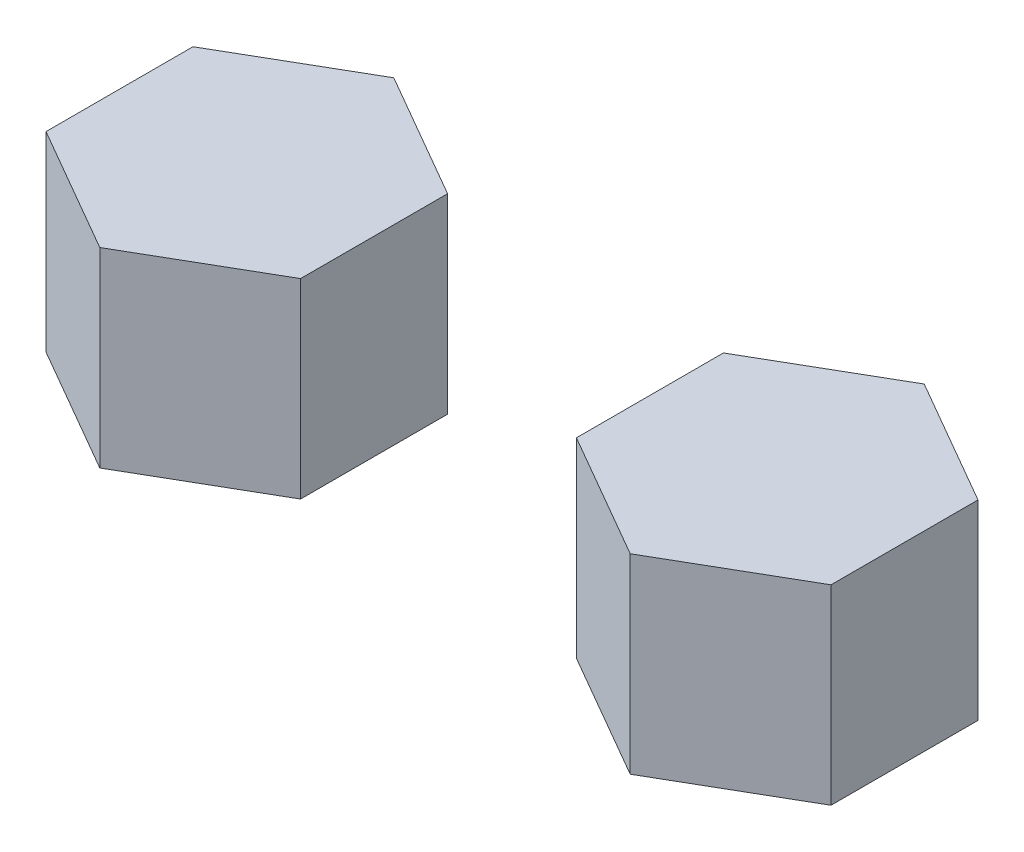
ISO-10303-21;
HEADER;
FILE_DESCRIPTION(('STEP AP214'),'2;1');
FILE_NAME('part.step','',(''),(''),'','','');
FILE_SCHEMA(('AUTOMOTIVE_DESIGN { 1 0 10303 214 1 1 1 1 }'));
ENDSEC;
DATA;
#1=APPLICATION_CONTEXT('core data for automotive mechanical design processes');
#2=APPLICATION_PROTOCOL_DEFINITION('international standard','automotive_design',2000,#1);
#3=PRODUCT_CONTEXT('',#1,'mechanical');
#4=PRODUCT('Part','Part','',(#3));
#5=PRODUCT_RELATED_PRODUCT_CATEGORY('part','',(#4));
#6=PRODUCT_DEFINITION_FORMATION('','',#4);
#7=PRODUCT_DEFINITION_CONTEXT('part definition',#1,'design');
#8=PRODUCT_DEFINITION('design','',#6,#7);
#9=PRODUCT_DEFINITION_SHAPE('','',#8);
#10=(LENGTH_UNIT() NAMED_UNIT(*) SI_UNIT(.MILLI.,.METRE.));
#11=(NAMED_UNIT(*) PLANE_ANGLE_UNIT() SI_UNIT($,.RADIAN.));
#12=(NAMED_UNIT(*) SI_UNIT($,.STERADIAN.) SOLID_ANGLE_UNIT());
#13=UNCERTAINTY_MEASURE_WITH_UNIT(LENGTH_MEASURE(1.E-05),#10,'distance_accuracy_value','');
#14=(GEOMETRIC_REPRESENTATION_CONTEXT(3) GLOBAL_UNCERTAINTY_ASSIGNED_CONTEXT((#13)) GLOBAL_UNIT_ASSIGNED_CONTEXT((#10,
#11,#12)) REPRESENTATION_CONTEXT('',''));
#15=CARTESIAN_POINT('',(0.,0.,0.));
#16=DIRECTION('',(0.,0.,1.));
#17=DIRECTION('',(1.,0.,0.));
#18=AXIS2_PLACEMENT_3D('',#15,#16,#17);
#19=CARTESIAN_POINT('',(-160.,-2.,-101.773502691896));
#20=DIRECTION('',(1.,0.,0.));
#21=DIRECTION('',(0.,0.,1.));
#22=AXIS2_PLACEMENT_3D('',#19,#20,#21);
#23=PLANE('',#22);
#24=DIRECTION('',(0.,0.,1.));
#25=VECTOR('',#24,1.);
#26=CARTESIAN_POINT('',(-160.,-20.,-101.773502691896));
#27=LINE('',#26,#25);
#28=CARTESIAN_POINT('',(-160.,-20.,-101.773502691896));
#29=VERTEX_POINT('',#28);
#30=CARTESIAN_POINT('',(-160.,-20.,-87.9170962313453));
#31=VERTEX_POINT('',#30);
#32=EDGE_CURVE('E144',#29,#31,#27,.T.);
#33=ORIENTED_EDGE('',*,*,#32,.T.);
#34=DIRECTION('',(0.,-1.,0.));
#35=VECTOR('',#34,1.);
#36=CARTESIAN_POINT('',(-160.,-2.,-87.9170962313453));
#37=LINE('',#36,#35);
#38=CARTESIAN_POINT('',(-160.,-2.,-87.9170962313453));
#39=VERTEX_POINT('',#38);
#40=EDGE_CURVE('E11',#39,#31,#37,.T.);
#41=ORIENTED_EDGE('',*,*,#40,.F.);
#42=DIRECTION('',(0.,0.,1.));
#43=VECTOR('',#42,1.);
#44=CARTESIAN_POINT('',(-160.,-2.,-101.773502691896));
#45=LINE('',#44,#43);
#46=CARTESIAN_POINT('',(-160.,-2.,-101.773502691896));
#47=VERTEX_POINT('',#46);
#48=EDGE_CURVE('E587',#47,#39,#45,.T.);
#49=ORIENTED_EDGE('',*,*,#48,.F.);
#50=DIRECTION('',(0.,-1.,0.));
#51=VECTOR('',#50,1.);
#52=CARTESIAN_POINT('',(-160.,-2.,-101.773502691896));
#53=LINE('',#52,#51);
#54=EDGE_CURVE('E162',#47,#29,#53,.T.);
#55=ORIENTED_EDGE('',*,*,#54,.T.);
#56=EDGE_LOOP('',(#33,#41,#49,#55));
#57=FACE_BOUND('',#56,.T.);
#58=ADVANCED_FACE('F17',(#57),#23,.F.);
#59=CARTESIAN_POINT('',(-160.,-2.,-87.9170962313453));
#60=DIRECTION('',(0.5,0.,-0.866025403784437));
#61=DIRECTION('',(0.866025403784437,0.,0.5));
#62=AXIS2_PLACEMENT_3D('',#59,#60,#61);
#63=PLANE('',#62);
#64=DIRECTION('',(0.866025403784437,0.,0.5));
#65=VECTOR('',#64,1.);
#66=CARTESIAN_POINT('',(-160.,-20.,-87.9170962313453));
#67=LINE('',#66,#65);
#68=CARTESIAN_POINT('',(-148.,-20.,-80.9888930010697));
#69=VERTEX_POINT('',#68);
#70=EDGE_CURVE('E148',#31,#69,#67,.T.);
#71=ORIENTED_EDGE('',*,*,#70,.T.);
#72=DIRECTION('',(0.,-1.,0.));
#73=VECTOR('',#72,1.);
#74=CARTESIAN_POINT('',(-148.,-2.,-80.9888930010697));
#75=LINE('',#74,#73);
#76=CARTESIAN_POINT('',(-148.,-2.,-80.9888930010697));
#77=VERTEX_POINT('',#76);
#78=EDGE_CURVE('E27',#77,#69,#75,.T.);
#79=ORIENTED_EDGE('',*,*,#78,.F.);
#80=DIRECTION('',(0.866025403784437,0.,0.5));
#81=VECTOR('',#80,1.);
#82=CARTESIAN_POINT('',(-160.,-2.,-87.9170962313453));
#83=LINE('',#82,#81);
#84=EDGE_CURVE('E590',#39,#77,#83,.T.);
#85=ORIENTED_EDGE('',*,*,#84,.F.);
#86=ORIENTED_EDGE('',*,*,#40,.T.);
#87=EDGE_LOOP('',(#71,#79,#85,#86));
#88=FACE_BOUND('',#87,.T.);
#89=ADVANCED_FACE('F393',(#88),#63,.F.);
#90=CARTESIAN_POINT('',(-148.,-2.,-80.9888930010697));
#91=DIRECTION('',(-0.5,0.,-0.86602540378444));
#92=DIRECTION('',(0.86602540378444,0.,-0.5));
#93=AXIS2_PLACEMENT_3D('',#90,#91,#92);
#94=PLANE('',#93);
#95=DIRECTION('',(0.86602540378444,0.,-0.5));
#96=VECTOR('',#95,1.);
#97=CARTESIAN_POINT('',(-148.,-20.,-80.9888930010697));
#98=LINE('',#97,#96);
#99=CARTESIAN_POINT('',(-136.,-20.,-87.9170962313452));
#100=VERTEX_POINT('',#99);
#101=EDGE_CURVE('E156',#69,#100,#98,.T.);
#102=ORIENTED_EDGE('',*,*,#101,.T.);
#103=DIRECTION('',(0.,-1.,0.));
#104=VECTOR('',#103,1.);
#105=CARTESIAN_POINT('',(-136.,-2.,-87.9170962313452));
#106=LINE('',#105,#104);
#107=CARTESIAN_POINT('',(-136.,-2.,-87.9170962313452));
#108=VERTEX_POINT('',#107);
#109=EDGE_CURVE('E170',#108,#100,#106,.T.);
#110=ORIENTED_EDGE('',*,*,#109,.F.);
#111=DIRECTION('',(0.86602540378444,0.,-0.5));
#112=VECTOR('',#111,1.);
#113=CARTESIAN_POINT('',(-148.,-2.,-80.9888930010697));
#114=LINE('',#113,#112);
#115=EDGE_CURVE('E572',#77,#108,#114,.T.);
#116=ORIENTED_EDGE('',*,*,#115,.F.);
#117=ORIENTED_EDGE('',*,*,#78,.T.);
#118=EDGE_LOOP('',(#102,#110,#116,#117));
#119=FACE_BOUND('',#118,.T.);
#120=ADVANCED_FACE('F381',(#119),#94,.F.);
#121=CARTESIAN_POINT('',(-136.,-2.,-87.9170962313452));
#122=DIRECTION('',(-1.,0.,0.));
#123=DIRECTION('',(0.,0.,-1.));
#124=AXIS2_PLACEMENT_3D('',#121,#122,#123);
#125=PLANE('',#124);
#126=DIRECTION('',(0.,0.,-1.));
#127=VECTOR('',#126,1.);
#128=CARTESIAN_POINT('',(-136.,-20.,-87.9170962313452));
#129=LINE('',#128,#127);
#130=CARTESIAN_POINT('',(-136.,-20.,-101.773502691896));
#131=VERTEX_POINT('',#130);
#132=EDGE_CURVE('E575',#100,#131,#129,.T.);
#133=ORIENTED_EDGE('',*,*,#132,.T.);
#134=DIRECTION('',(0.,-1.,0.));
#135=VECTOR('',#134,1.);
#136=CARTESIAN_POINT('',(-136.,-2.,-101.773502691896));
#137=LINE('',#136,#135);
#138=CARTESIAN_POINT('',(-136.,-2.,-101.773502691896));
#139=VERTEX_POINT('',#138);
#140=EDGE_CURVE('E167',#139,#131,#137,.T.);
#141=ORIENTED_EDGE('',*,*,#140,.F.);
#142=DIRECTION('',(0.,0.,-1.));
#143=VECTOR('',#142,1.);
#144=CARTESIAN_POINT('',(-136.,-2.,-87.9170962313452));
#145=LINE('',#144,#143);
#146=EDGE_CURVE('E598',#108,#139,#145,.T.);
#147=ORIENTED_EDGE('',*,*,#146,.F.);
#148=ORIENTED_EDGE('',*,*,#109,.T.);
#149=EDGE_LOOP('',(#133,#141,#147,#148));
#150=FACE_BOUND('',#149,.T.);
#151=ADVANCED_FACE('F369',(#150),#125,.F.);
#152=CARTESIAN_POINT('',(-136.,-2.,-101.773502691896));
#153=DIRECTION('',(-0.5,0.,0.866025403784437));
#154=DIRECTION('',(-0.866025403784437,0.,-0.5));
#155=AXIS2_PLACEMENT_3D('',#152,#153,#154);
#156=PLANE('',#155);
#157=DIRECTION('',(-0.866025403784437,0.,-0.5));
#158=VECTOR('',#157,1.);
#159=CARTESIAN_POINT('',(-136.,-20.,-101.773502691896));
#160=LINE('',#159,#158);
#161=CARTESIAN_POINT('',(-148.,-20.,-108.701705922172));
#162=VERTEX_POINT('',#161);
#163=EDGE_CURVE('E580',#131,#162,#160,.T.);
#164=ORIENTED_EDGE('',*,*,#163,.T.);
#165=DIRECTION('',(0.,-1.,0.));
#166=VECTOR('',#165,1.);
#167=CARTESIAN_POINT('',(-148.,-2.,-108.701705922172));
#168=LINE('',#167,#166);
#169=CARTESIAN_POINT('',(-148.,-2.,-108.701705922172));
#170=VERTEX_POINT('',#169);
#171=EDGE_CURVE('E164',#170,#162,#168,.T.);
#172=ORIENTED_EDGE('',*,*,#171,.F.);
#173=DIRECTION('',(-0.866025403784437,0.,-0.5));
#174=VECTOR('',#173,1.);
#175=CARTESIAN_POINT('',(-136.,-2.,-101.773502691896));
#176=LINE('',#175,#174);
#177=EDGE_CURVE('E596',#139,#170,#176,.T.);
#178=ORIENTED_EDGE('',*,*,#177,.F.);
#179=ORIENTED_EDGE('',*,*,#140,.T.);
#180=EDGE_LOOP('',(#164,#172,#178,#179));
#181=FACE_BOUND('',#180,.T.);
#182=ADVANCED_FACE('F357',(#181),#156,.F.);
#183=CARTESIAN_POINT('',(-148.,-2.,-108.701705922172));
#184=DIRECTION('',(0.5,0.,0.86602540378444));
#185=DIRECTION('',(-0.86602540378444,0.,0.5));
#186=AXIS2_PLACEMENT_3D('',#183,#184,#185);
#187=PLANE('',#186);
#188=DIRECTION('',(-0.86602540378444,0.,0.5));
#189=VECTOR('',#188,1.);
#190=CARTESIAN_POINT('',(-148.,-20.,-108.701705922172));
#191=LINE('',#190,#189);
#192=EDGE_CURVE('E160',#162,#29,#191,.T.);
#193=ORIENTED_EDGE('',*,*,#192,.T.);
#194=ORIENTED_EDGE('',*,*,#54,.F.);
#195=DIRECTION('',(-0.86602540378444,0.,0.5));
#196=VECTOR('',#195,1.);
#197=CARTESIAN_POINT('',(-148.,-2.,-108.701705922172));
#198=LINE('',#197,#196);
#199=EDGE_CURVE('E36',#170,#47,#198,.T.);
#200=ORIENTED_EDGE('',*,*,#199,.F.);
#201=ORIENTED_EDGE('',*,*,#171,.T.);
#202=EDGE_LOOP('',(#193,#194,#200,#201));
#203=FACE_BOUND('',#202,.T.);
#204=ADVANCED_FACE('F346',(#203),#187,.F.);
#205=CARTESIAN_POINT('',(-148.,-2.,-94.8452994616208));
#206=DIRECTION('',(0.,1.,0.));
#207=DIRECTION('',(0.86602540378444,0.,-0.5));
#208=AXIS2_PLACEMENT_3D('',#205,#206,#207);
#209=PLANE('',#208);
#210=ORIENTED_EDGE('',*,*,#48,.T.);
#211=ORIENTED_EDGE('',*,*,#84,.T.);
#212=ORIENTED_EDGE('',*,*,#115,.T.);
#213=ORIENTED_EDGE('',*,*,#146,.T.);
#214=ORIENTED_EDGE('',*,*,#177,.T.);
#215=ORIENTED_EDGE('',*,*,#199,.T.);
#216=EDGE_LOOP('',(#210,#211,#212,#213,#214,#215));
#217=FACE_BOUND('',#216,.T.);
#218=ADVANCED_FACE('F336',(#217),#209,.T.);
#219=CARTESIAN_POINT('',(-148.,-20.,-94.8452994616208));
#220=DIRECTION('',(0.,1.,0.));
#221=DIRECTION('',(0.86602540378444,0.,-0.5));
#222=AXIS2_PLACEMENT_3D('',#219,#220,#221);
#223=PLANE('',#222);
#224=ORIENTED_EDGE('',*,*,#32,.F.);
#225=ORIENTED_EDGE('',*,*,#192,.F.);
#226=ORIENTED_EDGE('',*,*,#163,.F.);
#227=ORIENTED_EDGE('',*,*,#132,.F.);
#228=ORIENTED_EDGE('',*,*,#101,.F.);
#229=ORIENTED_EDGE('',*,*,#70,.F.);
#230=EDGE_LOOP('',(#224,#225,#226,#227,#228,#229));
#231=FACE_BOUND('',#230,.T.);
#232=ADVANCED_FACE('F232',(#231),#223,.F.);
#233=CLOSED_SHELL('',(#58,#89,#120,#151,#182,#204,#218,#232));
#234=MANIFOLD_SOLID_BREP('B1',#233);
#235=CARTESIAN_POINT('',(-86.,-2.,-87.9170962313451));
#236=DIRECTION('',(-1.,0.,0.));
#237=DIRECTION('',(0.,0.,-1.));
#238=AXIS2_PLACEMENT_3D('',#235,#236,#237);
#239=PLANE('',#238);
#240=DIRECTION('',(0.,0.,-1.));
#241=VECTOR('',#240,1.);
#242=CARTESIAN_POINT('',(-86.,-20.,-87.9170962313451));
#243=LINE('',#242,#241);
#244=CARTESIAN_POINT('',(-86.,-20.,-87.9170962313451));
#245=VERTEX_POINT('',#244);
#246=CARTESIAN_POINT('',(-86.,-20.,-101.773502691896));
#247=VERTEX_POINT('',#246);
#248=EDGE_CURVE('E117',#245,#247,#243,.T.);
#249=ORIENTED_EDGE('',*,*,#248,.T.);
#250=DIRECTION('',(0.,-1.,0.));
#251=VECTOR('',#250,1.);
#252=CARTESIAN_POINT('',(-86.,-2.,-101.773502691896));
#253=LINE('',#252,#251);
#254=CARTESIAN_POINT('',(-86.,-2.,-101.773502691896));
#255=VERTEX_POINT('',#254);
#256=EDGE_CURVE('E21',#255,#247,#253,.T.);
#257=ORIENTED_EDGE('',*,*,#256,.F.);
#258=DIRECTION('',(0.,0.,-1.));
#259=VECTOR('',#258,1.);
#260=CARTESIAN_POINT('',(-86.,-2.,-87.9170962313451));
#261=LINE('',#260,#259);
#262=CARTESIAN_POINT('',(-86.,-2.,-87.9170962313451));
#263=VERTEX_POINT('',#262);
#264=EDGE_CURVE('E112',#263,#255,#261,.T.);
#265=ORIENTED_EDGE('',*,*,#264,.F.);
#266=DIRECTION('',(0.,-1.,0.));
#267=VECTOR('',#266,1.);
#268=CARTESIAN_POINT('',(-86.,-2.,-87.9170962313451));
#269=LINE('',#268,#267);
#270=EDGE_CURVE('E106',#263,#245,#269,.T.);
#271=ORIENTED_EDGE('',*,*,#270,.T.);
#272=EDGE_LOOP('',(#249,#257,#265,#271));
#273=FACE_BOUND('',#272,.T.);
#274=ADVANCED_FACE('F19',(#273),#239,.F.);
#275=CARTESIAN_POINT('',(-86.,-2.,-101.773502691896));
#276=DIRECTION('',(-0.5,0.,0.866025403784437));
#277=DIRECTION('',(-0.866025403784437,0.,-0.5));
#278=AXIS2_PLACEMENT_3D('',#275,#276,#277);
#279=PLANE('',#278);
#280=DIRECTION('',(-0.866025403784437,0.,-0.5));
#281=VECTOR('',#280,1.);
#282=CARTESIAN_POINT('',(-86.,-20.,-101.773502691896));
#283=LINE('',#282,#281);
#284=CARTESIAN_POINT('',(-98.,-20.,-108.701705922172));
#285=VERTEX_POINT('',#284);
#286=EDGE_CURVE('E123',#247,#285,#283,.T.);
#287=ORIENTED_EDGE('',*,*,#286,.T.);
#288=DIRECTION('',(0.,-1.,0.));
#289=VECTOR('',#288,1.);
#290=CARTESIAN_POINT('',(-98.,-2.,-108.701705922172));
#291=LINE('',#290,#289);
#292=CARTESIAN_POINT('',(-98.,-2.,-108.701705922172));
#293=VERTEX_POINT('',#292);
#294=EDGE_CURVE('E139',#293,#285,#291,.T.);
#295=ORIENTED_EDGE('',*,*,#294,.F.);
#296=DIRECTION('',(-0.866025403784437,0.,-0.5));
#297=VECTOR('',#296,1.);
#298=CARTESIAN_POINT('',(-86.,-2.,-101.773502691896));
#299=LINE('',#298,#297);
#300=EDGE_CURVE('E175',#255,#293,#299,.T.);
#301=ORIENTED_EDGE('',*,*,#300,.F.);
#302=ORIENTED_EDGE('',*,*,#256,.T.);
#303=EDGE_LOOP('',(#287,#295,#301,#302));
#304=FACE_BOUND('',#303,.T.);
#305=ADVANCED_FACE('F209',(#304),#279,.F.);
#306=CARTESIAN_POINT('',(-98.,-2.,-108.701705922172));
#307=DIRECTION('',(0.5,0.,0.86602540378444));
#308=DIRECTION('',(-0.86602540378444,0.,0.5));
#309=AXIS2_PLACEMENT_3D('',#306,#307,#308);
#310=PLANE('',#309);
#311=DIRECTION('',(-0.86602540378444,0.,0.5));
#312=VECTOR('',#311,1.);
#313=CARTESIAN_POINT('',(-98.,-20.,-108.701705922172));
#314=LINE('',#313,#312);
#315=CARTESIAN_POINT('',(-110.,-20.,-101.773502691896));
#316=VERTEX_POINT('',#315);
#317=EDGE_CURVE('E130',#285,#316,#314,.T.);
#318=ORIENTED_EDGE('',*,*,#317,.T.);
#319=DIRECTION('',(0.,-1.,0.));
#320=VECTOR('',#319,1.);
#321=CARTESIAN_POINT('',(-110.,-2.,-101.773502691896));
#322=LINE('',#321,#320);
#323=CARTESIAN_POINT('',(-110.,-2.,-101.773502691896));
#324=VERTEX_POINT('',#323);
#325=EDGE_CURVE('E137',#324,#316,#322,.T.);
#326=ORIENTED_EDGE('',*,*,#325,.F.);
#327=DIRECTION('',(-0.86602540378444,0.,0.5));
#328=VECTOR('',#327,1.);
#329=CARTESIAN_POINT('',(-98.,-2.,-108.701705922172));
#330=LINE('',#329,#328);
#331=EDGE_CURVE('E177',#293,#324,#330,.T.);
#332=ORIENTED_EDGE('',*,*,#331,.F.);
#333=ORIENTED_EDGE('',*,*,#294,.T.);
#334=EDGE_LOOP('',(#318,#326,#332,#333));
#335=FACE_BOUND('',#334,.T.);
#336=ADVANCED_FACE('F207',(#335),#310,.F.);
#337=CARTESIAN_POINT('',(-110.,-2.,-101.773502691896));
#338=DIRECTION('',(1.,0.,0.));
#339=DIRECTION('',(0.,0.,1.));
#340=AXIS2_PLACEMENT_3D('',#337,#338,#339);
#341=PLANE('',#340);
#342=DIRECTION('',(0.,0.,1.));
#343=VECTOR('',#342,1.);
#344=CARTESIAN_POINT('',(-110.,-20.,-101.773502691896));
#345=LINE('',#344,#343);
#346=CARTESIAN_POINT('',(-110.,-20.,-87.9170962313451));
#347=VERTEX_POINT('',#346);
#348=EDGE_CURVE('E187',#316,#347,#345,.T.);
#349=ORIENTED_EDGE('',*,*,#348,.T.);
#350=DIRECTION('',(0.,-1.,0.));
#351=VECTOR('',#350,1.);
#352=CARTESIAN_POINT('',(-110.,-2.,-87.9170962313451));
#353=LINE('',#352,#351);
#354=CARTESIAN_POINT('',(-110.,-2.,-87.9170962313451));
#355=VERTEX_POINT('',#354);
#356=EDGE_CURVE('E135',#355,#347,#353,.T.);
#357=ORIENTED_EDGE('',*,*,#356,.F.);
#358=DIRECTION('',(0.,0.,1.));
#359=VECTOR('',#358,1.);
#360=CARTESIAN_POINT('',(-110.,-2.,-101.773502691896));
#361=LINE('',#360,#359);
#362=EDGE_CURVE('E179',#324,#355,#361,.T.);
#363=ORIENTED_EDGE('',*,*,#362,.F.);
#364=ORIENTED_EDGE('',*,*,#325,.T.);
#365=EDGE_LOOP('',(#349,#357,#363,#364));
#366=FACE_BOUND('',#365,.T.);
#367=ADVANCED_FACE('F200',(#366),#341,.F.);
#368=CARTESIAN_POINT('',(-110.,-2.,-87.9170962313451));
#369=DIRECTION('',(0.5,0.,-0.866025403784437));
#370=DIRECTION('',(0.866025403784437,0.,0.5));
#371=AXIS2_PLACEMENT_3D('',#368,#369,#370);
#372=PLANE('',#371);
#373=DIRECTION('',(0.866025403784437,0.,0.5));
#374=VECTOR('',#373,1.);
#375=CARTESIAN_POINT('',(-110.,-20.,-87.9170962313451));
#376=LINE('',#375,#374);
#377=CARTESIAN_POINT('',(-98.,-20.,-80.9888930010696));
#378=VERTEX_POINT('',#377);
#379=EDGE_CURVE('E96',#347,#378,#376,.T.);
#380=ORIENTED_EDGE('',*,*,#379,.T.);
#381=DIRECTION('',(0.,-1.,0.));
#382=VECTOR('',#381,1.);
#383=CARTESIAN_POINT('',(-98.,-2.,-80.9888930010696));
#384=LINE('',#383,#382);
#385=CARTESIAN_POINT('',(-98.,-2.,-80.9888930010696));
#386=VERTEX_POINT('',#385);
#387=EDGE_CURVE('E108',#386,#378,#384,.T.);
#388=ORIENTED_EDGE('',*,*,#387,.F.);
#389=DIRECTION('',(0.866025403784437,0.,0.5));
#390=VECTOR('',#389,1.);
#391=CARTESIAN_POINT('',(-110.,-2.,-87.9170962313451));
#392=LINE('',#391,#390);
#393=EDGE_CURVE('E181',#355,#386,#392,.T.);
#394=ORIENTED_EDGE('',*,*,#393,.F.);
#395=ORIENTED_EDGE('',*,*,#356,.T.);
#396=EDGE_LOOP('',(#380,#388,#394,#395));
#397=FACE_BOUND('',#396,.T.);
#398=ADVANCED_FACE('F204',(#397),#372,.F.);
#399=CARTESIAN_POINT('',(-98.,-2.,-80.9888930010696));
#400=DIRECTION('',(-0.5,0.,-0.86602540378444));
#401=DIRECTION('',(0.86602540378444,0.,-0.5));
#402=AXIS2_PLACEMENT_3D('',#399,#400,#401);
#403=PLANE('',#402);
#404=DIRECTION('',(0.86602540378444,0.,-0.5));
#405=VECTOR('',#404,1.);
#406=CARTESIAN_POINT('',(-98.,-20.,-80.9888930010696));
#407=LINE('',#406,#405);
#408=EDGE_CURVE('E102',#378,#245,#407,.T.);
#409=ORIENTED_EDGE('',*,*,#408,.T.);
#410=ORIENTED_EDGE('',*,*,#270,.F.);
#411=DIRECTION('',(0.86602540378444,0.,-0.5));
#412=VECTOR('',#411,1.);
#413=CARTESIAN_POINT('',(-98.,-2.,-80.9888930010696));
#414=LINE('',#413,#412);
#415=EDGE_CURVE('E119',#386,#263,#414,.T.);
#416=ORIENTED_EDGE('',*,*,#415,.F.);
#417=ORIENTED_EDGE('',*,*,#387,.T.);
#418=EDGE_LOOP('',(#409,#410,#416,#417));
#419=FACE_BOUND('',#418,.T.);
#420=ADVANCED_FACE('F104',(#419),#403,.F.);
#421=CARTESIAN_POINT('',(-98.,-2.,-94.8452994616206));
#422=DIRECTION('',(0.,1.,0.));
#423=DIRECTION('',(-0.86602540378444,0.,0.5));
#424=AXIS2_PLACEMENT_3D('',#421,#422,#423);
#425=PLANE('',#424);
#426=ORIENTED_EDGE('',*,*,#264,.T.);
#427=ORIENTED_EDGE('',*,*,#300,.T.);
#428=ORIENTED_EDGE('',*,*,#331,.T.);
#429=ORIENTED_EDGE('',*,*,#362,.T.);
#430=ORIENTED_EDGE('',*,*,#393,.T.);
#431=ORIENTED_EDGE('',*,*,#415,.T.);
#432=EDGE_LOOP('',(#426,#427,#428,#429,#430,#431));
#433=FACE_BOUND('',#432,.T.);
#434=ADVANCED_FACE('F206',(#433),#425,.T.);
#435=CARTESIAN_POINT('',(-98.,-20.,-94.8452994616206));
#436=DIRECTION('',(0.,1.,0.));
#437=DIRECTION('',(-0.86602540378444,0.,0.5));
#438=AXIS2_PLACEMENT_3D('',#435,#436,#437);
#439=PLANE('',#438);
#440=ORIENTED_EDGE('',*,*,#248,.F.);
#441=ORIENTED_EDGE('',*,*,#408,.F.);
#442=ORIENTED_EDGE('',*,*,#379,.F.);
#443=ORIENTED_EDGE('',*,*,#348,.F.);
#444=ORIENTED_EDGE('',*,*,#317,.F.);
#445=ORIENTED_EDGE('',*,*,#286,.F.);
#446=EDGE_LOOP('',(#440,#441,#442,#443,#444,#445));
#447=FACE_BOUND('',#446,.T.);
#448=ADVANCED_FACE('F121',(#447),#439,.F.);
#449=CLOSED_SHELL('',(#274,#305,#336,#367,#398,#420,#434,#448));
#450=MANIFOLD_SOLID_BREP('B1',#449);
#451=ADVANCED_BREP_SHAPE_REPRESENTATION('',(#18,#234,#450),#14);
#452=SHAPE_DEFINITION_REPRESENTATION(#9,#451);
ENDSEC;
END-ISO-10303-21;
